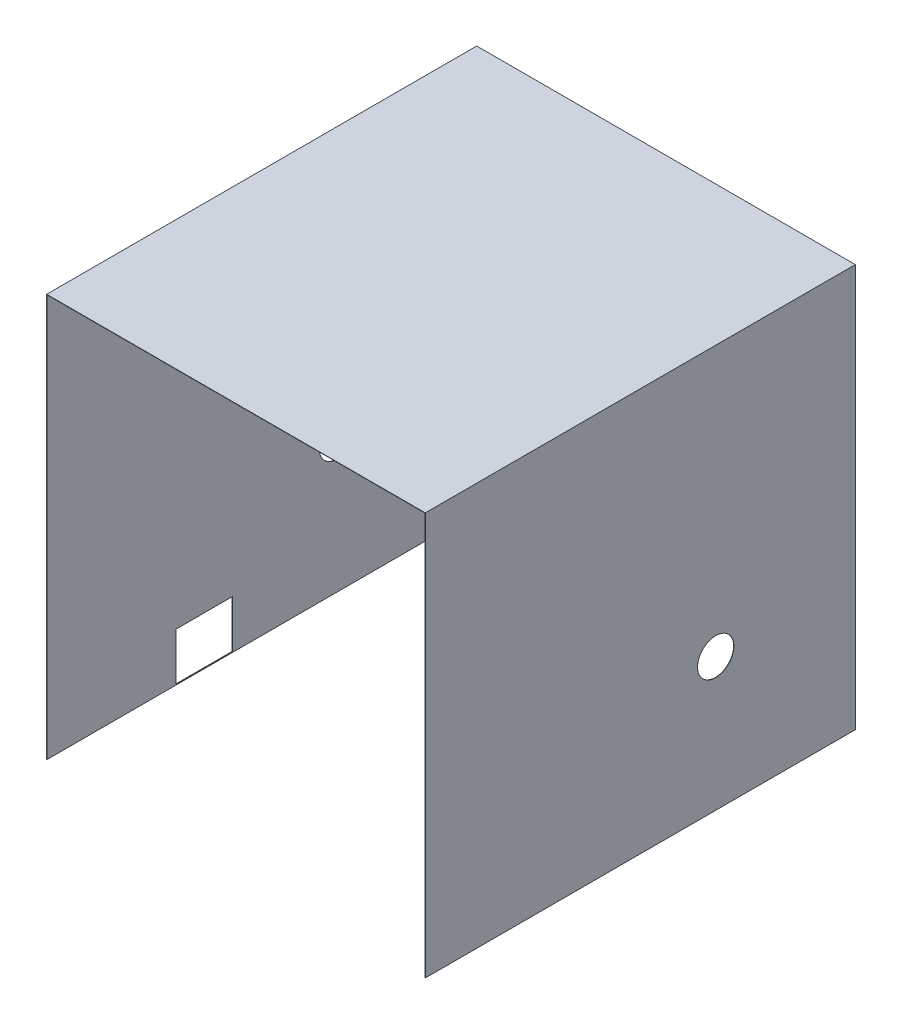
ISO-10303-21;
HEADER;
FILE_DESCRIPTION(('STEP AP214'),'2;1');
FILE_NAME('part.step','',(''),(''),'','','');
FILE_SCHEMA(('AUTOMOTIVE_DESIGN { 1 0 10303 214 1 1 1 1 }'));
ENDSEC;
DATA;
#1=APPLICATION_CONTEXT('core data for automotive mechanical design processes');
#2=APPLICATION_PROTOCOL_DEFINITION('international standard','automotive_design',2000,#1);
#3=PRODUCT_CONTEXT('',#1,'mechanical');
#4=PRODUCT('Part','Part','',(#3));
#5=PRODUCT_RELATED_PRODUCT_CATEGORY('part','',(#4));
#6=PRODUCT_DEFINITION_FORMATION('','',#4);
#7=PRODUCT_DEFINITION_CONTEXT('part definition',#1,'design');
#8=PRODUCT_DEFINITION('design','',#6,#7);
#9=PRODUCT_DEFINITION_SHAPE('','',#8);
#10=(LENGTH_UNIT() NAMED_UNIT(*) SI_UNIT(.MILLI.,.METRE.));
#11=(NAMED_UNIT(*) PLANE_ANGLE_UNIT() SI_UNIT($,.RADIAN.));
#12=(NAMED_UNIT(*) SI_UNIT($,.STERADIAN.) SOLID_ANGLE_UNIT());
#13=UNCERTAINTY_MEASURE_WITH_UNIT(LENGTH_MEASURE(1.E-05),#10,'distance_accuracy_value','');
#14=(GEOMETRIC_REPRESENTATION_CONTEXT(3) GLOBAL_UNCERTAINTY_ASSIGNED_CONTEXT((#13)) GLOBAL_UNIT_ASSIGNED_CONTEXT((#10,
#11,#12)) REPRESENTATION_CONTEXT('',''));
#15=CARTESIAN_POINT('',(0.,0.,0.));
#16=DIRECTION('',(0.,0.,1.));
#17=DIRECTION('',(1.,0.,0.));
#18=AXIS2_PLACEMENT_3D('',#15,#16,#17);
#19=CARTESIAN_POINT('',(-344.517995000733,0.,533.));
#20=DIRECTION('',(0.,1.,0.));
#21=DIRECTION('',(0.,0.,1.));
#22=AXIS2_PLACEMENT_3D('',#19,#20,#21);
#23=PLANE('',#22);
#24=DIRECTION('',(1.,0.,0.));
#25=VECTOR('',#24,1.);
#26=CARTESIAN_POINT('',(-344.517995000733,0.,0.));
#27=LINE('',#26,#25);
#28=CARTESIAN_POINT('',(-344.517995000733,0.,0.));
#29=VERTEX_POINT('',#28);
#30=CARTESIAN_POINT('',(-344.167995000733,0.,0.));
#31=VERTEX_POINT('',#30);
#32=EDGE_CURVE('E174',#29,#31,#27,.T.);
#33=ORIENTED_EDGE('',*,*,#32,.T.);
#34=DIRECTION('',(0.,0.,-1.));
#35=VECTOR('',#34,1.);
#36=CARTESIAN_POINT('',(-344.167995000733,0.,533.));
#37=LINE('',#36,#35);
#38=CARTESIAN_POINT('',(-344.167995000733,0.,533.));
#39=VERTEX_POINT('',#38);
#40=EDGE_CURVE('E11',#39,#31,#37,.T.);
#41=ORIENTED_EDGE('',*,*,#40,.F.);
#42=DIRECTION('',(1.,0.,0.));
#43=VECTOR('',#42,1.);
#44=CARTESIAN_POINT('',(-344.517995000733,0.,533.));
#45=LINE('',#44,#43);
#46=CARTESIAN_POINT('',(-344.517995000733,0.,533.));
#47=VERTEX_POINT('',#46);
#48=EDGE_CURVE('E175',#47,#39,#45,.T.);
#49=ORIENTED_EDGE('',*,*,#48,.F.);
#50=DIRECTION('',(0.,0.,-1.));
#51=VECTOR('',#50,1.);
#52=CARTESIAN_POINT('',(-344.517995000733,0.,533.));
#53=LINE('',#52,#51);
#54=EDGE_CURVE('E193',#47,#29,#53,.T.);
#55=ORIENTED_EDGE('',*,*,#54,.T.);
#56=EDGE_LOOP('',(#33,#41,#49,#55));
#57=FACE_BOUND('',#56,.T.);
#58=ADVANCED_FACE('F39',(#57),#23,.F.);
#59=CARTESIAN_POINT('',(-344.167995000733,0.,533.));
#60=DIRECTION('',(-1.,0.,0.));
#61=DIRECTION('',(0.,0.,1.));
#62=AXIS2_PLACEMENT_3D('',#59,#60,#61);
#63=PLANE('',#62);
#64=DIRECTION('',(0.,0.,-1.));
#65=VECTOR('',#64,1.);
#66=CARTESIAN_POINT('',(-344.167995000733,60.,533.));
#67=LINE('',#66,#65);
#68=CARTESIAN_POINT('',(-344.167995000733,60.,373.));
#69=VERTEX_POINT('',#68);
#70=CARTESIAN_POINT('',(-344.167995000733,60.,303.));
#71=VERTEX_POINT('',#70);
#72=EDGE_CURVE('E159',#69,#71,#67,.T.);
#73=ORIENTED_EDGE('',*,*,#72,.T.);
#74=DIRECTION('',(0.,-1.,0.));
#75=VECTOR('',#74,1.);
#76=CARTESIAN_POINT('',(-344.167995000733,0.,303.));
#77=LINE('',#76,#75);
#78=CARTESIAN_POINT('',(-344.167995000733,1.,303.));
#79=VERTEX_POINT('',#78);
#80=EDGE_CURVE('E162',#71,#79,#77,.T.);
#81=ORIENTED_EDGE('',*,*,#80,.T.);
#82=DIRECTION('',(0.,0.,1.));
#83=VECTOR('',#82,1.);
#84=CARTESIAN_POINT('',(-344.167995000733,0.999999999999998,533.));
#85=LINE('',#84,#83);
#86=CARTESIAN_POINT('',(-344.167995000733,1.,373.));
#87=VERTEX_POINT('',#86);
#88=EDGE_CURVE('E154',#79,#87,#85,.T.);
#89=ORIENTED_EDGE('',*,*,#88,.T.);
#90=DIRECTION('',(0.,1.,0.));
#91=VECTOR('',#90,1.);
#92=CARTESIAN_POINT('',(-344.167995000733,0.,373.));
#93=LINE('',#92,#91);
#94=EDGE_CURVE('E134',#87,#69,#93,.T.);
#95=ORIENTED_EDGE('',*,*,#94,.T.);
#96=EDGE_LOOP('',(#73,#81,#89,#95));
#97=FACE_BOUND('',#96,.T.);
#98=CARTESIAN_POINT('',(-344.167995000733,165.,173.));
#99=DIRECTION('',(-1.,0.,0.));
#100=DIRECTION('',(0.,0.,1.));
#101=AXIS2_PLACEMENT_3D('',#98,#99,#100);
#102=CIRCLE('',#101,22.5);
#103=CARTESIAN_POINT('',(-344.167995000733,165.,195.5));
#104=VERTEX_POINT('',#103);
#105=EDGE_CURVE('E171',#104,#104,#102,.T.);
#106=ORIENTED_EDGE('',*,*,#105,.T.);
#107=EDGE_LOOP('',(#106));
#108=FACE_BOUND('',#107,.T.);
#109=DIRECTION('',(0.,1.,0.));
#110=VECTOR('',#109,1.);
#111=CARTESIAN_POINT('',(-344.167995000733,0.,0.));
#112=LINE('',#111,#110);
#113=CARTESIAN_POINT('',(-344.167995000733,498.95,0.));
#114=VERTEX_POINT('',#113);
#115=EDGE_CURVE('E196',#31,#114,#112,.T.);
#116=ORIENTED_EDGE('',*,*,#115,.T.);
#117=DIRECTION('',(0.,0.,-1.));
#118=VECTOR('',#117,1.);
#119=CARTESIAN_POINT('',(-344.167995000733,498.95,533.));
#120=LINE('',#119,#118);
#121=CARTESIAN_POINT('',(-344.167995000733,498.95,533.));
#122=VERTEX_POINT('',#121);
#123=EDGE_CURVE('E47',#122,#114,#120,.T.);
#124=ORIENTED_EDGE('',*,*,#123,.F.);
#125=DIRECTION('',(0.,1.,0.));
#126=VECTOR('',#125,1.);
#127=CARTESIAN_POINT('',(-344.167995000733,0.,533.));
#128=LINE('',#127,#126);
#129=EDGE_CURVE('E178',#39,#122,#128,.T.);
#130=ORIENTED_EDGE('',*,*,#129,.F.);
#131=ORIENTED_EDGE('',*,*,#40,.T.);
#132=EDGE_LOOP('',(#116,#124,#130,#131));
#133=FACE_BOUND('',#132,.T.);
#134=ADVANCED_FACE('F254',(#97,#108,#133),#63,.F.);
#135=CARTESIAN_POINT('',(-344.167995000733,498.95,533.));
#136=DIRECTION('',(0.,1.,0.));
#137=DIRECTION('',(0.,0.,1.));
#138=AXIS2_PLACEMENT_3D('',#135,#136,#137);
#139=PLANE('',#138);
#140=DIRECTION('',(1.,0.,0.));
#141=VECTOR('',#140,1.);
#142=CARTESIAN_POINT('',(-344.167995000733,498.95,0.));
#143=LINE('',#142,#141);
#144=CARTESIAN_POINT('',(124.432004999267,498.95,0.));
#145=VERTEX_POINT('',#144);
#146=EDGE_CURVE('E198',#114,#145,#143,.T.);
#147=ORIENTED_EDGE('',*,*,#146,.T.);
#148=DIRECTION('',(0.,0.,-1.));
#149=VECTOR('',#148,1.);
#150=CARTESIAN_POINT('',(124.432004999267,498.95,533.));
#151=LINE('',#150,#149);
#152=CARTESIAN_POINT('',(124.432004999267,498.95,533.));
#153=VERTEX_POINT('',#152);
#154=EDGE_CURVE('E223',#153,#145,#151,.T.);
#155=ORIENTED_EDGE('',*,*,#154,.F.);
#156=DIRECTION('',(1.,0.,0.));
#157=VECTOR('',#156,1.);
#158=CARTESIAN_POINT('',(-344.167995000733,498.95,533.));
#159=LINE('',#158,#157);
#160=EDGE_CURVE('E181',#122,#153,#159,.T.);
#161=ORIENTED_EDGE('',*,*,#160,.F.);
#162=ORIENTED_EDGE('',*,*,#123,.T.);
#163=EDGE_LOOP('',(#147,#155,#161,#162));
#164=FACE_BOUND('',#163,.T.);
#165=ADVANCED_FACE('F231',(#164),#139,.F.);
#166=CARTESIAN_POINT('',(124.432004999267,498.95,533.));
#167=DIRECTION('',(1.,0.,0.));
#168=DIRECTION('',(0.,1.,0.));
#169=AXIS2_PLACEMENT_3D('',#166,#167,#168);
#170=PLANE('',#169);
#171=CARTESIAN_POINT('',(124.432004999267,165.,173.));
#172=DIRECTION('',(1.,0.,0.));
#173=DIRECTION('',(0.,1.,0.));
#174=AXIS2_PLACEMENT_3D('',#171,#172,#173);
#175=CIRCLE('',#174,22.5);
#176=CARTESIAN_POINT('',(124.432004999267,187.5,173.));
#177=VERTEX_POINT('',#176);
#178=EDGE_CURVE('E168',#177,#177,#175,.T.);
#179=ORIENTED_EDGE('',*,*,#178,.T.);
#180=EDGE_LOOP('',(#179));
#181=FACE_BOUND('',#180,.T.);
#182=DIRECTION('',(0.,-1.,0.));
#183=VECTOR('',#182,1.);
#184=CARTESIAN_POINT('',(124.432004999267,498.95,0.));
#185=LINE('',#184,#183);
#186=CARTESIAN_POINT('',(124.432004999267,0.,0.));
#187=VERTEX_POINT('',#186);
#188=EDGE_CURVE('E200',#145,#187,#185,.T.);
#189=ORIENTED_EDGE('',*,*,#188,.T.);
#190=DIRECTION('',(0.,0.,-1.));
#191=VECTOR('',#190,1.);
#192=CARTESIAN_POINT('',(124.432004999267,0.,533.));
#193=LINE('',#192,#191);
#194=CARTESIAN_POINT('',(124.432004999267,0.,533.));
#195=VERTEX_POINT('',#194);
#196=EDGE_CURVE('E220',#195,#187,#193,.T.);
#197=ORIENTED_EDGE('',*,*,#196,.F.);
#198=DIRECTION('',(0.,-1.,0.));
#199=VECTOR('',#198,1.);
#200=CARTESIAN_POINT('',(124.432004999267,498.95,533.));
#201=LINE('',#200,#199);
#202=EDGE_CURVE('E183',#153,#195,#201,.T.);
#203=ORIENTED_EDGE('',*,*,#202,.F.);
#204=ORIENTED_EDGE('',*,*,#154,.T.);
#205=EDGE_LOOP('',(#189,#197,#203,#204));
#206=FACE_BOUND('',#205,.T.);
#207=ADVANCED_FACE('F242',(#181,#206),#170,.F.);
#208=CARTESIAN_POINT('',(124.432004999267,0.,533.));
#209=DIRECTION('',(0.,1.,0.));
#210=DIRECTION('',(0.,0.,1.));
#211=AXIS2_PLACEMENT_3D('',#208,#209,#210);
#212=PLANE('',#211);
#213=DIRECTION('',(1.,0.,0.));
#214=VECTOR('',#213,1.);
#215=CARTESIAN_POINT('',(124.432004999267,0.,0.));
#216=LINE('',#215,#214);
#217=CARTESIAN_POINT('',(124.782004999267,0.,0.));
#218=VERTEX_POINT('',#217);
#219=EDGE_CURVE('E202',#187,#218,#216,.T.);
#220=ORIENTED_EDGE('',*,*,#219,.T.);
#221=DIRECTION('',(0.,0.,-1.));
#222=VECTOR('',#221,1.);
#223=CARTESIAN_POINT('',(124.782004999267,0.,533.));
#224=LINE('',#223,#222);
#225=CARTESIAN_POINT('',(124.782004999267,0.,533.));
#226=VERTEX_POINT('',#225);
#227=EDGE_CURVE('E217',#226,#218,#224,.T.);
#228=ORIENTED_EDGE('',*,*,#227,.F.);
#229=DIRECTION('',(1.,0.,0.));
#230=VECTOR('',#229,1.);
#231=CARTESIAN_POINT('',(124.432004999267,0.,533.));
#232=LINE('',#231,#230);
#233=EDGE_CURVE('E185',#195,#226,#232,.T.);
#234=ORIENTED_EDGE('',*,*,#233,.F.);
#235=ORIENTED_EDGE('',*,*,#196,.T.);
#236=EDGE_LOOP('',(#220,#228,#234,#235));
#237=FACE_BOUND('',#236,.T.);
#238=ADVANCED_FACE('F246',(#237),#212,.F.);
#239=CARTESIAN_POINT('',(124.782004999267,499.3,533.));
#240=DIRECTION('',(-1.,0.,0.));
#241=DIRECTION('',(0.,-1.,0.));
#242=AXIS2_PLACEMENT_3D('',#239,#240,#241);
#243=PLANE('',#242);
#244=CARTESIAN_POINT('',(124.782004999267,165.,173.));
#245=DIRECTION('',(1.,0.,0.));
#246=DIRECTION('',(0.,1.,0.));
#247=AXIS2_PLACEMENT_3D('',#244,#245,#246);
#248=CIRCLE('',#247,22.5);
#249=CARTESIAN_POINT('',(124.782004999267,187.5,173.));
#250=VERTEX_POINT('',#249);
#251=EDGE_CURVE('E165',#250,#250,#248,.T.);
#252=ORIENTED_EDGE('',*,*,#251,.F.);
#253=EDGE_LOOP('',(#252));
#254=FACE_BOUND('',#253,.T.);
#255=DIRECTION('',(0.,1.,0.));
#256=VECTOR('',#255,1.);
#257=CARTESIAN_POINT('',(124.782004999267,499.3,0.));
#258=LINE('',#257,#256);
#259=CARTESIAN_POINT('',(124.782004999267,499.3,0.));
#260=VERTEX_POINT('',#259);
#261=EDGE_CURVE('E204',#218,#260,#258,.T.);
#262=ORIENTED_EDGE('',*,*,#261,.T.);
#263=DIRECTION('',(0.,0.,-1.));
#264=VECTOR('',#263,1.);
#265=CARTESIAN_POINT('',(124.782004999267,499.3,533.));
#266=LINE('',#265,#264);
#267=CARTESIAN_POINT('',(124.782004999267,499.3,533.));
#268=VERTEX_POINT('',#267);
#269=EDGE_CURVE('E214',#268,#260,#266,.T.);
#270=ORIENTED_EDGE('',*,*,#269,.F.);
#271=DIRECTION('',(0.,1.,0.));
#272=VECTOR('',#271,1.);
#273=CARTESIAN_POINT('',(124.782004999267,499.3,533.));
#274=LINE('',#273,#272);
#275=EDGE_CURVE('E187',#226,#268,#274,.T.);
#276=ORIENTED_EDGE('',*,*,#275,.F.);
#277=ORIENTED_EDGE('',*,*,#227,.T.);
#278=EDGE_LOOP('',(#262,#270,#276,#277));
#279=FACE_BOUND('',#278,.T.);
#280=ADVANCED_FACE('F266',(#254,#279),#243,.F.);
#281=CARTESIAN_POINT('',(-344.517995000733,499.3,533.));
#282=DIRECTION('',(0.,-1.,0.));
#283=DIRECTION('',(0.,0.,-1.));
#284=AXIS2_PLACEMENT_3D('',#281,#282,#283);
#285=PLANE('',#284);
#286=DIRECTION('',(-1.,0.,0.));
#287=VECTOR('',#286,1.);
#288=CARTESIAN_POINT('',(-344.517995000733,499.3,0.));
#289=LINE('',#288,#287);
#290=CARTESIAN_POINT('',(-344.517995000733,499.3,0.));
#291=VERTEX_POINT('',#290);
#292=EDGE_CURVE('E206',#260,#291,#289,.T.);
#293=ORIENTED_EDGE('',*,*,#292,.T.);
#294=DIRECTION('',(0.,0.,-1.));
#295=VECTOR('',#294,1.);
#296=CARTESIAN_POINT('',(-344.517995000733,499.3,533.));
#297=LINE('',#296,#295);
#298=CARTESIAN_POINT('',(-344.517995000733,499.3,533.));
#299=VERTEX_POINT('',#298);
#300=EDGE_CURVE('E211',#299,#291,#297,.T.);
#301=ORIENTED_EDGE('',*,*,#300,.F.);
#302=DIRECTION('',(-1.,0.,0.));
#303=VECTOR('',#302,1.);
#304=CARTESIAN_POINT('',(-344.517995000733,499.3,533.));
#305=LINE('',#304,#303);
#306=EDGE_CURVE('E189',#268,#299,#305,.T.);
#307=ORIENTED_EDGE('',*,*,#306,.F.);
#308=ORIENTED_EDGE('',*,*,#269,.T.);
#309=EDGE_LOOP('',(#293,#301,#307,#308));
#310=FACE_BOUND('',#309,.T.);
#311=ADVANCED_FACE('F264',(#310),#285,.F.);
#312=CARTESIAN_POINT('',(-344.517995000733,0.,533.));
#313=DIRECTION('',(1.,0.,0.));
#314=DIRECTION('',(0.,0.,-1.));
#315=AXIS2_PLACEMENT_3D('',#312,#313,#314);
#316=PLANE('',#315);
#317=DIRECTION('',(0.,0.,1.));
#318=VECTOR('',#317,1.);
#319=CARTESIAN_POINT('',(-344.517995000733,1.,303.));
#320=LINE('',#319,#318);
#321=CARTESIAN_POINT('',(-344.517995000733,1.,303.));
#322=VERTEX_POINT('',#321);
#323=CARTESIAN_POINT('',(-344.517995000733,1.,373.));
#324=VERTEX_POINT('',#323);
#325=EDGE_CURVE('E140',#322,#324,#320,.T.);
#326=ORIENTED_EDGE('',*,*,#325,.F.);
#327=DIRECTION('',(0.,-1.,0.));
#328=VECTOR('',#327,1.);
#329=CARTESIAN_POINT('',(-344.517995000733,60.,303.));
#330=LINE('',#329,#328);
#331=CARTESIAN_POINT('',(-344.517995000733,60.,303.));
#332=VERTEX_POINT('',#331);
#333=EDGE_CURVE('E62',#332,#322,#330,.T.);
#334=ORIENTED_EDGE('',*,*,#333,.F.);
#335=DIRECTION('',(0.,0.,-1.));
#336=VECTOR('',#335,1.);
#337=CARTESIAN_POINT('',(-344.517995000733,60.,373.));
#338=LINE('',#337,#336);
#339=CARTESIAN_POINT('',(-344.517995000733,60.,373.));
#340=VERTEX_POINT('',#339);
#341=EDGE_CURVE('E147',#340,#332,#338,.T.);
#342=ORIENTED_EDGE('',*,*,#341,.F.);
#343=DIRECTION('',(0.,1.,0.));
#344=VECTOR('',#343,1.);
#345=CARTESIAN_POINT('',(-344.517995000733,1.,373.));
#346=LINE('',#345,#344);
#347=EDGE_CURVE('E131',#324,#340,#346,.T.);
#348=ORIENTED_EDGE('',*,*,#347,.F.);
#349=EDGE_LOOP('',(#326,#334,#342,#348));
#350=FACE_BOUND('',#349,.T.);
#351=CARTESIAN_POINT('',(-344.517995000733,165.,173.));
#352=DIRECTION('',(1.,0.,0.));
#353=DIRECTION('',(0.,0.,-1.));
#354=AXIS2_PLACEMENT_3D('',#351,#352,#353);
#355=CIRCLE('',#354,22.5);
#356=CARTESIAN_POINT('',(-344.517995000733,165.,150.5));
#357=VERTEX_POINT('',#356);
#358=EDGE_CURVE('E42',#357,#357,#355,.T.);
#359=ORIENTED_EDGE('',*,*,#358,.T.);
#360=EDGE_LOOP('',(#359));
#361=FACE_BOUND('',#360,.T.);
#362=DIRECTION('',(0.,-1.,0.));
#363=VECTOR('',#362,1.);
#364=CARTESIAN_POINT('',(-344.517995000733,0.,0.));
#365=LINE('',#364,#363);
#366=EDGE_CURVE('E179',#291,#29,#365,.T.);
#367=ORIENTED_EDGE('',*,*,#366,.T.);
#368=ORIENTED_EDGE('',*,*,#54,.F.);
#369=DIRECTION('',(0.,-1.,0.));
#370=VECTOR('',#369,1.);
#371=CARTESIAN_POINT('',(-344.517995000733,0.,533.));
#372=LINE('',#371,#370);
#373=EDGE_CURVE('E191',#299,#47,#372,.T.);
#374=ORIENTED_EDGE('',*,*,#373,.F.);
#375=ORIENTED_EDGE('',*,*,#300,.T.);
#376=EDGE_LOOP('',(#367,#368,#374,#375));
#377=FACE_BOUND('',#376,.T.);
#378=ADVANCED_FACE('F144',(#350,#361,#377),#316,.F.);
#379=CARTESIAN_POINT('',(0.,0.,533.));
#380=DIRECTION('',(0.,0.,1.));
#381=DIRECTION('',(1.,0.,0.));
#382=AXIS2_PLACEMENT_3D('',#379,#380,#381);
#383=PLANE('',#382);
#384=ORIENTED_EDGE('',*,*,#48,.T.);
#385=ORIENTED_EDGE('',*,*,#129,.T.);
#386=ORIENTED_EDGE('',*,*,#160,.T.);
#387=ORIENTED_EDGE('',*,*,#202,.T.);
#388=ORIENTED_EDGE('',*,*,#233,.T.);
#389=ORIENTED_EDGE('',*,*,#275,.T.);
#390=ORIENTED_EDGE('',*,*,#306,.T.);
#391=ORIENTED_EDGE('',*,*,#373,.T.);
#392=EDGE_LOOP('',(#384,#385,#386,#387,#388,#389,#390,#391));
#393=FACE_BOUND('',#392,.T.);
#394=ADVANCED_FACE('F250',(#393),#383,.T.);
#395=CARTESIAN_POINT('',(0.,0.,0.));
#396=DIRECTION('',(0.,0.,1.));
#397=DIRECTION('',(1.,0.,0.));
#398=AXIS2_PLACEMENT_3D('',#395,#396,#397);
#399=PLANE('',#398);
#400=ORIENTED_EDGE('',*,*,#32,.F.);
#401=ORIENTED_EDGE('',*,*,#366,.F.);
#402=ORIENTED_EDGE('',*,*,#292,.F.);
#403=ORIENTED_EDGE('',*,*,#261,.F.);
#404=ORIENTED_EDGE('',*,*,#219,.F.);
#405=ORIENTED_EDGE('',*,*,#188,.F.);
#406=ORIENTED_EDGE('',*,*,#146,.F.);
#407=ORIENTED_EDGE('',*,*,#115,.F.);
#408=EDGE_LOOP('',(#400,#401,#402,#403,#404,#405,#406,#407));
#409=FACE_BOUND('',#408,.T.);
#410=ADVANCED_FACE('F237',(#409),#399,.F.);
#411=CARTESIAN_POINT('',(-408.217995000733,165.,173.));
#412=DIRECTION('',(1.,0.,0.));
#413=DIRECTION('',(0.,1.,0.));
#414=AXIS2_PLACEMENT_3D('',#411,#412,#413);
#415=CYLINDRICAL_SURFACE('',#414,22.5);
#416=ORIENTED_EDGE('',*,*,#358,.F.);
#417=EDGE_LOOP('',(#416));
#418=FACE_BOUND('',#417,.T.);
#419=ORIENTED_EDGE('',*,*,#105,.F.);
#420=EDGE_LOOP('',(#419));
#421=FACE_BOUND('',#420,.T.);
#422=ADVANCED_FACE('F299',(#418,#421),#415,.F.);
#423=ORIENTED_EDGE('',*,*,#251,.T.);
#424=EDGE_LOOP('',(#423));
#425=FACE_BOUND('',#424,.T.);
#426=ORIENTED_EDGE('',*,*,#178,.F.);
#427=EDGE_LOOP('',(#426));
#428=FACE_BOUND('',#427,.T.);
#429=ADVANCED_FACE('F296',(#425,#428),#415,.F.);
#430=CARTESIAN_POINT('',(-101.517995000733,60.,303.));
#431=DIRECTION('',(0.,0.,-1.));
#432=DIRECTION('',(-1.,0.,0.));
#433=AXIS2_PLACEMENT_3D('',#430,#431,#432);
#434=PLANE('',#433);
#435=DIRECTION('',(-1.,0.,0.));
#436=VECTOR('',#435,1.);
#437=CARTESIAN_POINT('',(-101.517995000733,60.,303.));
#438=LINE('',#437,#436);
#439=EDGE_CURVE('E152',#71,#332,#438,.T.);
#440=ORIENTED_EDGE('',*,*,#439,.T.);
#441=ORIENTED_EDGE('',*,*,#333,.T.);
#442=DIRECTION('',(-1.,0.,0.));
#443=VECTOR('',#442,1.);
#444=CARTESIAN_POINT('',(-101.517995000733,1.,303.));
#445=LINE('',#444,#443);
#446=EDGE_CURVE('E137',#79,#322,#445,.T.);
#447=ORIENTED_EDGE('',*,*,#446,.F.);
#448=ORIENTED_EDGE('',*,*,#80,.F.);
#449=EDGE_LOOP('',(#440,#441,#447,#448));
#450=FACE_BOUND('',#449,.T.);
#451=ADVANCED_FACE('F298',(#450),#434,.F.);
#452=CARTESIAN_POINT('',(-101.517995000733,60.,373.));
#453=DIRECTION('',(0.,1.,0.));
#454=DIRECTION('',(0.,0.,1.));
#455=AXIS2_PLACEMENT_3D('',#452,#453,#454);
#456=PLANE('',#455);
#457=DIRECTION('',(-1.,0.,0.));
#458=VECTOR('',#457,1.);
#459=CARTESIAN_POINT('',(-101.517995000733,60.,373.));
#460=LINE('',#459,#458);
#461=EDGE_CURVE('E136',#69,#340,#460,.T.);
#462=ORIENTED_EDGE('',*,*,#461,.T.);
#463=ORIENTED_EDGE('',*,*,#341,.T.);
#464=ORIENTED_EDGE('',*,*,#439,.F.);
#465=ORIENTED_EDGE('',*,*,#72,.F.);
#466=EDGE_LOOP('',(#462,#463,#464,#465));
#467=FACE_BOUND('',#466,.T.);
#468=ADVANCED_FACE('F305',(#467),#456,.F.);
#469=CARTESIAN_POINT('',(-101.517995000733,1.,373.));
#470=DIRECTION('',(0.,0.,1.));
#471=DIRECTION('',(1.,0.,0.));
#472=AXIS2_PLACEMENT_3D('',#469,#470,#471);
#473=PLANE('',#472);
#474=DIRECTION('',(-1.,0.,0.));
#475=VECTOR('',#474,1.);
#476=CARTESIAN_POINT('',(-101.517995000733,1.,373.));
#477=LINE('',#476,#475);
#478=EDGE_CURVE('E54',#87,#324,#477,.T.);
#479=ORIENTED_EDGE('',*,*,#478,.T.);
#480=ORIENTED_EDGE('',*,*,#347,.T.);
#481=ORIENTED_EDGE('',*,*,#461,.F.);
#482=ORIENTED_EDGE('',*,*,#94,.F.);
#483=EDGE_LOOP('',(#479,#480,#481,#482));
#484=FACE_BOUND('',#483,.T.);
#485=ADVANCED_FACE('F128',(#484),#473,.F.);
#486=CARTESIAN_POINT('',(-101.517995000733,1.,303.));
#487=DIRECTION('',(0.,-1.,0.));
#488=DIRECTION('',(0.,0.,-1.));
#489=AXIS2_PLACEMENT_3D('',#486,#487,#488);
#490=PLANE('',#489);
#491=ORIENTED_EDGE('',*,*,#446,.T.);
#492=ORIENTED_EDGE('',*,*,#325,.T.);
#493=ORIENTED_EDGE('',*,*,#478,.F.);
#494=ORIENTED_EDGE('',*,*,#88,.F.);
#495=EDGE_LOOP('',(#491,#492,#493,#494));
#496=FACE_BOUND('',#495,.T.);
#497=ADVANCED_FACE('F141',(#496),#490,.F.);
#498=CLOSED_SHELL('',(#58,#134,#165,#207,#238,#280,#311,#378,#394,#410,#422,#429,#451,#468,#485,#497));
#499=MANIFOLD_SOLID_BREP('B2',#498);
#500=ADVANCED_BREP_SHAPE_REPRESENTATION('',(#18,#499),#14);
#501=SHAPE_DEFINITION_REPRESENTATION(#9,#500);
ENDSEC;
END-ISO-10303-21;
